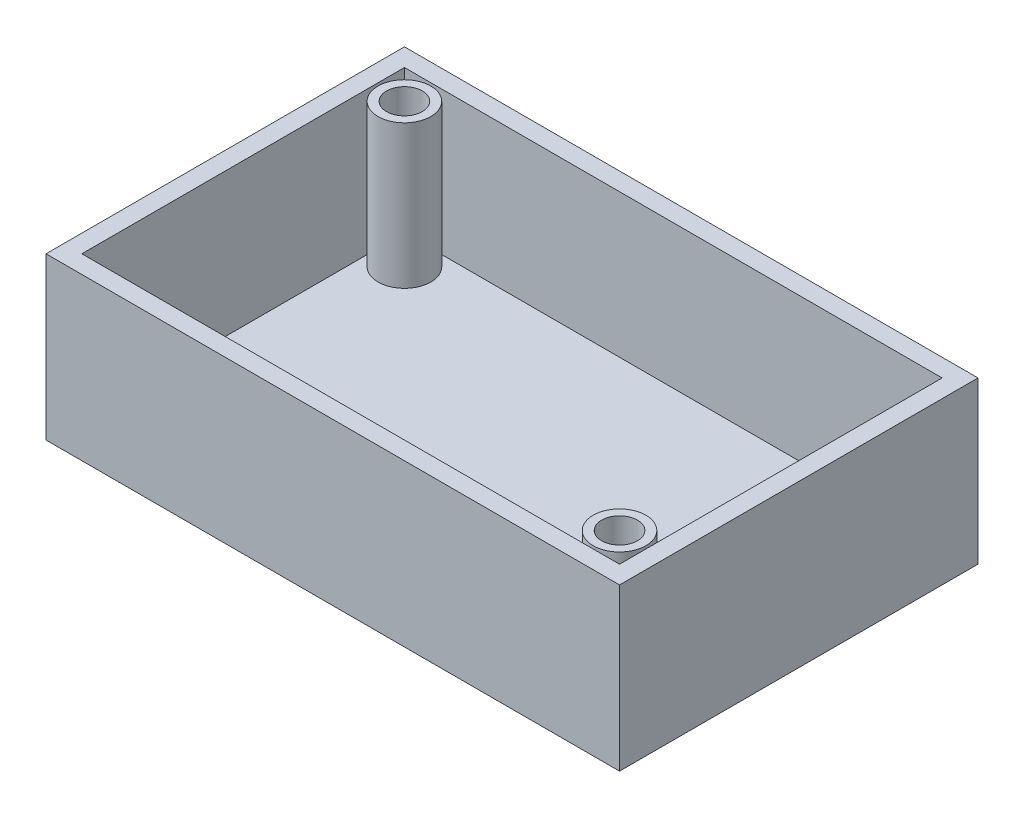
ISO-10303-21;
HEADER;
FILE_DESCRIPTION(('STEP AP214'),'2;1');
FILE_NAME('part.step','',(''),(''),'','','');
FILE_SCHEMA(('AUTOMOTIVE_DESIGN { 1 0 10303 214 1 1 1 1 }'));
ENDSEC;
DATA;
#1=APPLICATION_CONTEXT('core data for automotive mechanical design processes');
#2=APPLICATION_PROTOCOL_DEFINITION('international standard','automotive_design',2000,#1);
#3=PRODUCT_CONTEXT('',#1,'mechanical');
#4=PRODUCT('Part','Part','',(#3));
#5=PRODUCT_RELATED_PRODUCT_CATEGORY('part','',(#4));
#6=PRODUCT_DEFINITION_FORMATION('','',#4);
#7=PRODUCT_DEFINITION_CONTEXT('part definition',#1,'design');
#8=PRODUCT_DEFINITION('design','',#6,#7);
#9=PRODUCT_DEFINITION_SHAPE('','',#8);
#10=(LENGTH_UNIT() NAMED_UNIT(*) SI_UNIT(.MILLI.,.METRE.));
#11=(NAMED_UNIT(*) PLANE_ANGLE_UNIT() SI_UNIT($,.RADIAN.));
#12=(NAMED_UNIT(*) SI_UNIT($,.STERADIAN.) SOLID_ANGLE_UNIT());
#13=UNCERTAINTY_MEASURE_WITH_UNIT(LENGTH_MEASURE(1.E-05),#10,'distance_accuracy_value','');
#14=(GEOMETRIC_REPRESENTATION_CONTEXT(3) GLOBAL_UNCERTAINTY_ASSIGNED_CONTEXT((#13)) GLOBAL_UNIT_ASSIGNED_CONTEXT((#10,
#11,#12)) REPRESENTATION_CONTEXT('',''));
#15=CARTESIAN_POINT('',(0.,0.,0.));
#16=DIRECTION('',(0.,0.,1.));
#17=DIRECTION('',(1.,0.,0.));
#18=AXIS2_PLACEMENT_3D('',#15,#16,#17);
#19=CARTESIAN_POINT('',(-39.0769230769231,3.175,-55.545054945055));
#20=DIRECTION('',(1.,0.,0.));
#21=DIRECTION('',(0.,0.,-1.));
#22=AXIS2_PLACEMENT_3D('',#19,#20,#21);
#23=PLANE('',#22);
#24=DIRECTION('',(0.,0.,1.));
#25=VECTOR('',#24,1.);
#26=CARTESIAN_POINT('',(-39.0769230769231,0.,-55.545054945055));
#27=LINE('',#26,#25);
#28=CARTESIAN_POINT('',(-39.0769230769231,0.,-55.545054945055));
#29=VERTEX_POINT('',#28);
#30=CARTESIAN_POINT('',(-39.0769230769231,0.,7.95494505494504));
#31=VERTEX_POINT('',#30);
#32=EDGE_CURVE('E147',#29,#31,#27,.T.);
#33=ORIENTED_EDGE('',*,*,#32,.T.);
#34=DIRECTION('',(0.,-1.,0.));
#35=VECTOR('',#34,1.);
#36=CARTESIAN_POINT('',(-39.0769230769231,3.175,7.95494505494504));
#37=LINE('',#36,#35);
#38=CARTESIAN_POINT('',(-39.0769230769231,28.575,7.95494505494504));
#39=VERTEX_POINT('',#38);
#40=EDGE_CURVE('E165',#39,#31,#37,.T.);
#41=ORIENTED_EDGE('',*,*,#40,.F.);
#42=DIRECTION('',(0.,0.,1.));
#43=VECTOR('',#42,1.);
#44=CARTESIAN_POINT('',(-39.0769230769231,28.575,-55.545054945055));
#45=LINE('',#44,#43);
#46=CARTESIAN_POINT('',(-39.0769230769231,28.575,-55.545054945055));
#47=VERTEX_POINT('',#46);
#48=EDGE_CURVE('E138',#47,#39,#45,.T.);
#49=ORIENTED_EDGE('',*,*,#48,.F.);
#50=DIRECTION('',(0.,-1.,0.));
#51=VECTOR('',#50,1.);
#52=CARTESIAN_POINT('',(-39.0769230769231,3.175,-55.545054945055));
#53=LINE('',#52,#51);
#54=EDGE_CURVE('E156',#47,#29,#53,.T.);
#55=ORIENTED_EDGE('',*,*,#54,.T.);
#56=EDGE_LOOP('',(#33,#41,#49,#55));
#57=FACE_BOUND('',#56,.T.);
#58=ADVANCED_FACE('F34',(#57),#23,.F.);
#59=CARTESIAN_POINT('',(-39.0769230769231,3.175,7.95494505494504));
#60=DIRECTION('',(0.,0.,-1.));
#61=DIRECTION('',(-1.,0.,0.));
#62=AXIS2_PLACEMENT_3D('',#59,#60,#61);
#63=PLANE('',#62);
#64=DIRECTION('',(1.,0.,0.));
#65=VECTOR('',#64,1.);
#66=CARTESIAN_POINT('',(-39.0769230769231,0.,7.95494505494504));
#67=LINE('',#66,#65);
#68=CARTESIAN_POINT('',(62.5230769230769,0.,7.95494505494504));
#69=VERTEX_POINT('',#68);
#70=EDGE_CURVE('E150',#31,#69,#67,.T.);
#71=ORIENTED_EDGE('',*,*,#70,.T.);
#72=DIRECTION('',(0.,-1.,0.));
#73=VECTOR('',#72,1.);
#74=CARTESIAN_POINT('',(62.5230769230769,3.175,7.95494505494504));
#75=LINE('',#74,#73);
#76=CARTESIAN_POINT('',(62.5230769230769,28.575,7.95494505494504));
#77=VERTEX_POINT('',#76);
#78=EDGE_CURVE('E162',#77,#69,#75,.T.);
#79=ORIENTED_EDGE('',*,*,#78,.F.);
#80=DIRECTION('',(1.,0.,0.));
#81=VECTOR('',#80,1.);
#82=CARTESIAN_POINT('',(-39.0769230769231,28.575,7.95494505494504));
#83=LINE('',#82,#81);
#84=EDGE_CURVE('E141',#39,#77,#83,.T.);
#85=ORIENTED_EDGE('',*,*,#84,.F.);
#86=ORIENTED_EDGE('',*,*,#40,.T.);
#87=EDGE_LOOP('',(#71,#79,#85,#86));
#88=FACE_BOUND('',#87,.T.);
#89=ADVANCED_FACE('F199',(#88),#63,.F.);
#90=CARTESIAN_POINT('',(62.5230769230769,3.175,-55.545054945055));
#91=DIRECTION('',(-1.,0.,0.));
#92=DIRECTION('',(0.,0.,1.));
#93=AXIS2_PLACEMENT_3D('',#90,#91,#92);
#94=PLANE('',#93);
#95=DIRECTION('',(0.,0.,-1.));
#96=VECTOR('',#95,1.);
#97=CARTESIAN_POINT('',(62.5230769230769,0.,-55.545054945055));
#98=LINE('',#97,#96);
#99=CARTESIAN_POINT('',(62.5230769230769,0.,-55.545054945055));
#100=VERTEX_POINT('',#99);
#101=EDGE_CURVE('E152',#69,#100,#98,.T.);
#102=ORIENTED_EDGE('',*,*,#101,.T.);
#103=DIRECTION('',(0.,-1.,0.));
#104=VECTOR('',#103,1.);
#105=CARTESIAN_POINT('',(62.5230769230769,3.175,-55.545054945055));
#106=LINE('',#105,#104);
#107=CARTESIAN_POINT('',(62.5230769230769,28.575,-55.545054945055));
#108=VERTEX_POINT('',#107);
#109=EDGE_CURVE('E159',#108,#100,#106,.T.);
#110=ORIENTED_EDGE('',*,*,#109,.F.);
#111=DIRECTION('',(0.,0.,-1.));
#112=VECTOR('',#111,1.);
#113=CARTESIAN_POINT('',(62.5230769230769,28.575,7.95494505494504));
#114=LINE('',#113,#112);
#115=EDGE_CURVE('E144',#77,#108,#114,.T.);
#116=ORIENTED_EDGE('',*,*,#115,.F.);
#117=ORIENTED_EDGE('',*,*,#78,.T.);
#118=EDGE_LOOP('',(#102,#110,#116,#117));
#119=FACE_BOUND('',#118,.T.);
#120=ADVANCED_FACE('F204',(#119),#94,.F.);
#121=CARTESIAN_POINT('',(-39.0769230769231,3.175,-55.545054945055));
#122=DIRECTION('',(0.,0.,1.));
#123=DIRECTION('',(1.,0.,0.));
#124=AXIS2_PLACEMENT_3D('',#121,#122,#123);
#125=PLANE('',#124);
#126=DIRECTION('',(-1.,0.,0.));
#127=VECTOR('',#126,1.);
#128=CARTESIAN_POINT('',(-39.0769230769231,0.,-55.545054945055));
#129=LINE('',#128,#127);
#130=EDGE_CURVE('E154',#100,#29,#129,.T.);
#131=ORIENTED_EDGE('',*,*,#130,.T.);
#132=ORIENTED_EDGE('',*,*,#54,.F.);
#133=DIRECTION('',(-1.,0.,0.));
#134=VECTOR('',#133,1.);
#135=CARTESIAN_POINT('',(62.5230769230769,28.575,-55.545054945055));
#136=LINE('',#135,#134);
#137=EDGE_CURVE('E112',#108,#47,#136,.T.);
#138=ORIENTED_EDGE('',*,*,#137,.F.);
#139=ORIENTED_EDGE('',*,*,#109,.T.);
#140=EDGE_LOOP('',(#131,#132,#138,#139));
#141=FACE_BOUND('',#140,.T.);
#142=ADVANCED_FACE('F218',(#141),#125,.F.);
#143=CARTESIAN_POINT('',(0.,0.,0.));
#144=DIRECTION('',(0.,1.,0.));
#145=DIRECTION('',(0.,0.,1.));
#146=AXIS2_PLACEMENT_3D('',#143,#144,#145);
#147=PLANE('',#146);
#148=CARTESIAN_POINT('',(47.8144068358278,0.,-23.77728958125));
#149=DIRECTION('',(0.,-1.,0.));
#150=DIRECTION('',(0.,0.,-1.));
#151=AXIS2_PLACEMENT_3D('',#148,#149,#150);
#152=CIRCLE('',#151,2.14114132606958);
#153=CARTESIAN_POINT('',(47.8144068358278,0.,-25.9184309073196));
#154=VERTEX_POINT('',#153);
#155=EDGE_CURVE('E390',#154,#154,#152,.T.);
#156=ORIENTED_EDGE('',*,*,#155,.F.);
#157=EDGE_LOOP('',(#156));
#158=FACE_BOUND('',#157,.T.);
#159=ORIENTED_EDGE('',*,*,#32,.F.);
#160=ORIENTED_EDGE('',*,*,#130,.F.);
#161=ORIENTED_EDGE('',*,*,#101,.F.);
#162=ORIENTED_EDGE('',*,*,#70,.F.);
#163=EDGE_LOOP('',(#159,#160,#161,#162));
#164=FACE_BOUND('',#163,.T.);
#165=ADVANCED_FACE('F210',(#158,#164),#147,.F.);
#166=CARTESIAN_POINT('',(0.,28.575,0.));
#167=DIRECTION('',(0.,1.,0.));
#168=DIRECTION('',(0.,0.,1.));
#169=AXIS2_PLACEMENT_3D('',#166,#167,#168);
#170=PLANE('',#169);
#171=ORIENTED_EDGE('',*,*,#137,.T.);
#172=ORIENTED_EDGE('',*,*,#48,.T.);
#173=ORIENTED_EDGE('',*,*,#84,.T.);
#174=ORIENTED_EDGE('',*,*,#115,.T.);
#175=EDGE_LOOP('',(#171,#172,#173,#174));
#176=FACE_BOUND('',#175,.T.);
#177=DIRECTION('',(1.,0.,0.));
#178=VECTOR('',#177,1.);
#179=CARTESIAN_POINT('',(-35.9019230769231,28.575,4.77994505494504));
#180=LINE('',#179,#178);
#181=CARTESIAN_POINT('',(-35.9019230769231,28.575,4.77994505494504));
#182=VERTEX_POINT('',#181);
#183=CARTESIAN_POINT('',(59.3480769230769,28.575,4.77994505494504));
#184=VERTEX_POINT('',#183);
#185=EDGE_CURVE('E106',#182,#184,#180,.T.);
#186=ORIENTED_EDGE('',*,*,#185,.F.);
#187=DIRECTION('',(0.,0.,1.));
#188=VECTOR('',#187,1.);
#189=CARTESIAN_POINT('',(-35.9019230769231,28.575,-52.370054945055));
#190=LINE('',#189,#188);
#191=CARTESIAN_POINT('',(-35.9019230769231,28.575,-52.370054945055));
#192=VERTEX_POINT('',#191);
#193=EDGE_CURVE('E97',#192,#182,#190,.T.);
#194=ORIENTED_EDGE('',*,*,#193,.F.);
#195=DIRECTION('',(-1.,0.,0.));
#196=VECTOR('',#195,1.);
#197=CARTESIAN_POINT('',(59.3480769230769,28.575,-52.370054945055));
#198=LINE('',#197,#196);
#199=CARTESIAN_POINT('',(59.3480769230769,28.575,-52.370054945055));
#200=VERTEX_POINT('',#199);
#201=EDGE_CURVE('E120',#200,#192,#198,.T.);
#202=ORIENTED_EDGE('',*,*,#201,.F.);
#203=DIRECTION('',(0.,0.,-1.));
#204=VECTOR('',#203,1.);
#205=CARTESIAN_POINT('',(59.3480769230769,28.575,4.77994505494504));
#206=LINE('',#205,#204);
#207=EDGE_CURVE('E118',#184,#200,#206,.T.);
#208=ORIENTED_EDGE('',*,*,#207,.F.);
#209=EDGE_LOOP('',(#186,#194,#202,#208));
#210=FACE_BOUND('',#209,.T.);
#211=ADVANCED_FACE('F116',(#176,#210),#170,.T.);
#212=CARTESIAN_POINT('',(-35.9019230769231,28.575,-52.370054945055));
#213=DIRECTION('',(1.,0.,0.));
#214=DIRECTION('',(0.,0.,-1.));
#215=AXIS2_PLACEMENT_3D('',#212,#213,#214);
#216=PLANE('',#215);
#217=DIRECTION('',(0.,0.,1.));
#218=VECTOR('',#217,1.);
#219=CARTESIAN_POINT('',(-35.9019230769231,3.175,-52.370054945055));
#220=LINE('',#219,#218);
#221=CARTESIAN_POINT('',(-35.9019230769231,3.175,-52.370054945055));
#222=VERTEX_POINT('',#221);
#223=CARTESIAN_POINT('',(-35.9019230769231,3.175,4.77994505494504));
#224=VERTEX_POINT('',#223);
#225=EDGE_CURVE('E48',#222,#224,#220,.T.);
#226=ORIENTED_EDGE('',*,*,#225,.F.);
#227=DIRECTION('',(0.,-1.,0.));
#228=VECTOR('',#227,1.);
#229=CARTESIAN_POINT('',(-35.9019230769231,28.575,-52.370054945055));
#230=LINE('',#229,#228);
#231=EDGE_CURVE('E102',#192,#222,#230,.T.);
#232=ORIENTED_EDGE('',*,*,#231,.F.);
#233=ORIENTED_EDGE('',*,*,#193,.T.);
#234=DIRECTION('',(0.,-1.,0.));
#235=VECTOR('',#234,1.);
#236=CARTESIAN_POINT('',(-35.9019230769231,28.575,4.77994505494504));
#237=LINE('',#236,#235);
#238=EDGE_CURVE('E100',#182,#224,#237,.T.);
#239=ORIENTED_EDGE('',*,*,#238,.T.);
#240=EDGE_LOOP('',(#226,#232,#233,#239));
#241=FACE_BOUND('',#240,.T.);
#242=ADVANCED_FACE('F99',(#241),#216,.T.);
#243=CARTESIAN_POINT('',(-35.9019230769231,28.575,4.77994505494504));
#244=DIRECTION('',(0.,0.,-1.));
#245=DIRECTION('',(-1.,0.,0.));
#246=AXIS2_PLACEMENT_3D('',#243,#244,#245);
#247=PLANE('',#246);
#248=DIRECTION('',(1.,0.,0.));
#249=VECTOR('',#248,1.);
#250=CARTESIAN_POINT('',(-35.9019230769231,3.175,4.77994505494504));
#251=LINE('',#250,#249);
#252=CARTESIAN_POINT('',(59.3480769230769,3.175,4.77994505494504));
#253=VERTEX_POINT('',#252);
#254=EDGE_CURVE('E52',#224,#253,#251,.T.);
#255=ORIENTED_EDGE('',*,*,#254,.F.);
#256=ORIENTED_EDGE('',*,*,#238,.F.);
#257=ORIENTED_EDGE('',*,*,#185,.T.);
#258=DIRECTION('',(0.,-1.,0.));
#259=VECTOR('',#258,1.);
#260=CARTESIAN_POINT('',(59.3480769230769,28.575,4.77994505494504));
#261=LINE('',#260,#259);
#262=EDGE_CURVE('E113',#184,#253,#261,.T.);
#263=ORIENTED_EDGE('',*,*,#262,.T.);
#264=EDGE_LOOP('',(#255,#256,#257,#263));
#265=FACE_BOUND('',#264,.T.);
#266=ADVANCED_FACE('F110',(#265),#247,.T.);
#267=CARTESIAN_POINT('',(59.3480769230769,28.575,4.77994505494504));
#268=DIRECTION('',(-1.,0.,0.));
#269=DIRECTION('',(0.,0.,1.));
#270=AXIS2_PLACEMENT_3D('',#267,#268,#269);
#271=PLANE('',#270);
#272=DIRECTION('',(0.,0.,-1.));
#273=VECTOR('',#272,1.);
#274=CARTESIAN_POINT('',(59.3480769230769,3.175,4.77994505494504));
#275=LINE('',#274,#273);
#276=CARTESIAN_POINT('',(59.3480769230769,3.175,-52.370054945055));
#277=VERTEX_POINT('',#276);
#278=EDGE_CURVE('E128',#253,#277,#275,.T.);
#279=ORIENTED_EDGE('',*,*,#278,.F.);
#280=ORIENTED_EDGE('',*,*,#262,.F.);
#281=ORIENTED_EDGE('',*,*,#207,.T.);
#282=DIRECTION('',(0.,-1.,0.));
#283=VECTOR('',#282,1.);
#284=CARTESIAN_POINT('',(59.3480769230769,28.575,-52.370054945055));
#285=LINE('',#284,#283);
#286=EDGE_CURVE('E132',#200,#277,#285,.T.);
#287=ORIENTED_EDGE('',*,*,#286,.T.);
#288=EDGE_LOOP('',(#279,#280,#281,#287));
#289=FACE_BOUND('',#288,.T.);
#290=ADVANCED_FACE('F291',(#289),#271,.T.);
#291=CARTESIAN_POINT('',(59.3480769230769,28.575,-52.370054945055));
#292=DIRECTION('',(0.,0.,1.));
#293=DIRECTION('',(1.,0.,0.));
#294=AXIS2_PLACEMENT_3D('',#291,#292,#293);
#295=PLANE('',#294);
#296=DIRECTION('',(-1.,0.,0.));
#297=VECTOR('',#296,1.);
#298=CARTESIAN_POINT('',(59.3480769230769,3.175,-52.370054945055));
#299=LINE('',#298,#297);
#300=EDGE_CURVE('E107',#277,#222,#299,.T.);
#301=ORIENTED_EDGE('',*,*,#300,.F.);
#302=ORIENTED_EDGE('',*,*,#286,.F.);
#303=ORIENTED_EDGE('',*,*,#201,.T.);
#304=ORIENTED_EDGE('',*,*,#231,.T.);
#305=EDGE_LOOP('',(#301,#302,#303,#304));
#306=FACE_BOUND('',#305,.T.);
#307=ADVANCED_FACE('F193',(#306),#295,.T.);
#308=CARTESIAN_POINT('',(0.,3.175,0.));
#309=DIRECTION('',(0.,1.,0.));
#310=DIRECTION('',(0.,0.,1.));
#311=AXIS2_PLACEMENT_3D('',#308,#309,#310);
#312=PLANE('',#311);
#313=CARTESIAN_POINT('',(54.1680769230769,3.175,-0.400054945054966));
#314=DIRECTION('',(0.,1.,0.));
#315=DIRECTION('',(0.,0.,1.));
#316=AXIS2_PLACEMENT_3D('',#313,#314,#315);
#317=CIRCLE('',#316,4.675);
#318=CARTESIAN_POINT('',(54.1680769230769,3.175,4.27494505494503));
#319=VERTEX_POINT('',#318);
#320=EDGE_CURVE('E381',#319,#319,#317,.T.);
#321=ORIENTED_EDGE('',*,*,#320,.F.);
#322=EDGE_LOOP('',(#321));
#323=FACE_BOUND('',#322,.T.);
#324=CARTESIAN_POINT('',(-30.7269230769231,3.175,-47.190054945055));
#325=DIRECTION('',(0.,1.,0.));
#326=DIRECTION('',(0.,0.,1.));
#327=AXIS2_PLACEMENT_3D('',#324,#325,#326);
#328=CIRCLE('',#327,4.675);
#329=CARTESIAN_POINT('',(-30.7269230769231,3.175,-42.515054945055));
#330=VERTEX_POINT('',#329);
#331=EDGE_CURVE('E376',#330,#330,#328,.T.);
#332=ORIENTED_EDGE('',*,*,#331,.F.);
#333=EDGE_LOOP('',(#332));
#334=FACE_BOUND('',#333,.T.);
#335=CARTESIAN_POINT('',(47.8144068358278,3.175,-23.77728958125));
#336=DIRECTION('',(0.,-1.,0.));
#337=DIRECTION('',(0.,0.,-1.));
#338=AXIS2_PLACEMENT_3D('',#335,#336,#337);
#339=CIRCLE('',#338,2.14114132606958);
#340=CARTESIAN_POINT('',(47.8144068358278,3.175,-25.9184309073196));
#341=VERTEX_POINT('',#340);
#342=EDGE_CURVE('E126',#341,#341,#339,.T.);
#343=ORIENTED_EDGE('',*,*,#342,.T.);
#344=EDGE_LOOP('',(#343));
#345=FACE_BOUND('',#344,.T.);
#346=ORIENTED_EDGE('',*,*,#225,.T.);
#347=ORIENTED_EDGE('',*,*,#254,.T.);
#348=ORIENTED_EDGE('',*,*,#278,.T.);
#349=ORIENTED_EDGE('',*,*,#300,.T.);
#350=EDGE_LOOP('',(#346,#347,#348,#349));
#351=FACE_BOUND('',#350,.T.);
#352=ADVANCED_FACE('F177',(#323,#334,#345,#351),#312,.T.);
#353=CARTESIAN_POINT('',(47.8144068358278,3.175,-23.77728958125));
#354=DIRECTION('',(0.,-1.,0.));
#355=DIRECTION('',(0.,0.,-1.));
#356=AXIS2_PLACEMENT_3D('',#353,#354,#355);
#357=CYLINDRICAL_SURFACE('',#356,2.14114132606958);
#358=ORIENTED_EDGE('',*,*,#342,.F.);
#359=EDGE_LOOP('',(#358));
#360=FACE_BOUND('',#359,.T.);
#361=ORIENTED_EDGE('',*,*,#155,.T.);
#362=EDGE_LOOP('',(#361));
#363=FACE_BOUND('',#362,.T.);
#364=ADVANCED_FACE('F192',(#360,#363),#357,.F.);
#365=CARTESIAN_POINT('',(-30.7269230769231,28.575,-47.190054945055));
#366=DIRECTION('',(0.,-1.,0.));
#367=DIRECTION('',(0.,0.,-1.));
#368=AXIS2_PLACEMENT_3D('',#365,#366,#367);
#369=CYLINDRICAL_SURFACE('',#368,3.175);
#370=CARTESIAN_POINT('',(-30.7269230769231,28.575,-47.190054945055));
#371=DIRECTION('',(0.,1.,0.));
#372=DIRECTION('',(0.,0.,1.));
#373=AXIS2_PLACEMENT_3D('',#370,#371,#372);
#374=CIRCLE('',#373,3.175);
#375=CARTESIAN_POINT('',(-30.7269230769231,28.575,-44.015054945055));
#376=VERTEX_POINT('',#375);
#377=EDGE_CURVE('E379',#376,#376,#374,.T.);
#378=ORIENTED_EDGE('',*,*,#377,.T.);
#379=EDGE_LOOP('',(#378));
#380=FACE_BOUND('',#379,.T.);
#381=CARTESIAN_POINT('',(-30.7269230769231,3.175,-47.190054945055));
#382=DIRECTION('',(0.,1.,0.));
#383=DIRECTION('',(0.,0.,1.));
#384=AXIS2_PLACEMENT_3D('',#381,#382,#383);
#385=CIRCLE('',#384,3.175);
#386=CARTESIAN_POINT('',(-30.7269230769231,3.175,-44.015054945055));
#387=VERTEX_POINT('',#386);
#388=EDGE_CURVE('E41',#387,#387,#385,.F.);
#389=ORIENTED_EDGE('',*,*,#388,.T.);
#390=EDGE_LOOP('',(#389));
#391=FACE_BOUND('',#390,.T.);
#392=ADVANCED_FACE('F170',(#380,#391),#369,.F.);
#393=CARTESIAN_POINT('',(-30.7269230769231,28.575,-47.190054945055));
#394=DIRECTION('',(0.,-1.,0.));
#395=DIRECTION('',(0.,0.,-1.));
#396=AXIS2_PLACEMENT_3D('',#393,#394,#395);
#397=CYLINDRICAL_SURFACE('',#396,4.675);
#398=CARTESIAN_POINT('',(-30.7269230769231,28.575,-47.190054945055));
#399=DIRECTION('',(0.,1.,0.));
#400=DIRECTION('',(0.,0.,1.));
#401=AXIS2_PLACEMENT_3D('',#398,#399,#400);
#402=CIRCLE('',#401,4.675);
#403=CARTESIAN_POINT('',(-30.7269230769231,28.575,-42.515054945055));
#404=VERTEX_POINT('',#403);
#405=EDGE_CURVE('E388',#404,#404,#402,.T.);
#406=ORIENTED_EDGE('',*,*,#405,.F.);
#407=EDGE_LOOP('',(#406));
#408=FACE_BOUND('',#407,.T.);
#409=ORIENTED_EDGE('',*,*,#331,.T.);
#410=EDGE_LOOP('',(#409));
#411=FACE_BOUND('',#410,.T.);
#412=ADVANCED_FACE('F186',(#408,#411),#397,.T.);
#413=CARTESIAN_POINT('',(0.,28.575,0.));
#414=DIRECTION('',(0.,1.,0.));
#415=DIRECTION('',(0.,0.,1.));
#416=AXIS2_PLACEMENT_3D('',#413,#414,#415);
#417=PLANE('',#416);
#418=ORIENTED_EDGE('',*,*,#377,.F.);
#419=EDGE_LOOP('',(#418));
#420=FACE_BOUND('',#419,.T.);
#421=ORIENTED_EDGE('',*,*,#405,.T.);
#422=EDGE_LOOP('',(#421));
#423=FACE_BOUND('',#422,.T.);
#424=ADVANCED_FACE('F175',(#420,#423),#417,.T.);
#425=ORIENTED_EDGE('',*,*,#388,.F.);
#426=EDGE_LOOP('',(#425));
#427=FACE_BOUND('',#426,.T.);
#428=ADVANCED_FACE('F172',(#427),#312,.T.);
#429=CARTESIAN_POINT('',(54.1680769230769,28.575,-0.400054945054966));
#430=DIRECTION('',(0.,-1.,0.));
#431=DIRECTION('',(0.,0.,-1.));
#432=AXIS2_PLACEMENT_3D('',#429,#430,#431);
#433=CYLINDRICAL_SURFACE('',#432,3.175);
#434=CARTESIAN_POINT('',(54.1680769230769,28.575,-0.400054945054966));
#435=DIRECTION('',(0.,1.,0.));
#436=DIRECTION('',(0.,0.,1.));
#437=AXIS2_PLACEMENT_3D('',#434,#435,#436);
#438=CIRCLE('',#437,3.175);
#439=CARTESIAN_POINT('',(54.1680769230769,28.575,2.77494505494503));
#440=VERTEX_POINT('',#439);
#441=EDGE_CURVE('E372',#440,#440,#438,.T.);
#442=ORIENTED_EDGE('',*,*,#441,.T.);
#443=EDGE_LOOP('',(#442));
#444=FACE_BOUND('',#443,.T.);
#445=CARTESIAN_POINT('',(54.1680769230769,3.175,-0.400054945054966));
#446=DIRECTION('',(0.,1.,0.));
#447=DIRECTION('',(0.,0.,1.));
#448=AXIS2_PLACEMENT_3D('',#445,#446,#447);
#449=CIRCLE('',#448,3.175);
#450=CARTESIAN_POINT('',(54.1680769230769,3.175,2.77494505494503));
#451=VERTEX_POINT('',#450);
#452=EDGE_CURVE('E11',#451,#451,#449,.F.);
#453=ORIENTED_EDGE('',*,*,#452,.T.);
#454=EDGE_LOOP('',(#453));
#455=FACE_BOUND('',#454,.T.);
#456=ADVANCED_FACE('F174',(#444,#455),#433,.F.);
#457=CARTESIAN_POINT('',(54.1680769230769,28.575,-0.400054945054966));
#458=DIRECTION('',(0.,-1.,0.));
#459=DIRECTION('',(0.,0.,-1.));
#460=AXIS2_PLACEMENT_3D('',#457,#458,#459);
#461=CYLINDRICAL_SURFACE('',#460,4.675);
#462=CARTESIAN_POINT('',(54.1680769230769,28.575,-0.400054945054966));
#463=DIRECTION('',(0.,1.,0.));
#464=DIRECTION('',(0.,0.,1.));
#465=AXIS2_PLACEMENT_3D('',#462,#463,#464);
#466=CIRCLE('',#465,4.675);
#467=CARTESIAN_POINT('',(54.1680769230769,28.575,4.27494505494503));
#468=VERTEX_POINT('',#467);
#469=EDGE_CURVE('E375',#468,#468,#466,.T.);
#470=ORIENTED_EDGE('',*,*,#469,.F.);
#471=EDGE_LOOP('',(#470));
#472=FACE_BOUND('',#471,.T.);
#473=ORIENTED_EDGE('',*,*,#320,.T.);
#474=EDGE_LOOP('',(#473));
#475=FACE_BOUND('',#474,.T.);
#476=ADVANCED_FACE('F183',(#472,#475),#461,.T.);
#477=CARTESIAN_POINT('',(0.,28.575,0.));
#478=DIRECTION('',(0.,1.,0.));
#479=DIRECTION('',(0.,0.,1.));
#480=AXIS2_PLACEMENT_3D('',#477,#478,#479);
#481=PLANE('',#480);
#482=ORIENTED_EDGE('',*,*,#441,.F.);
#483=EDGE_LOOP('',(#482));
#484=FACE_BOUND('',#483,.T.);
#485=ORIENTED_EDGE('',*,*,#469,.T.);
#486=EDGE_LOOP('',(#485));
#487=FACE_BOUND('',#486,.T.);
#488=ADVANCED_FACE('F196',(#484,#487),#481,.T.);
#489=ORIENTED_EDGE('',*,*,#452,.F.);
#490=EDGE_LOOP('',(#489));
#491=FACE_BOUND('',#490,.T.);
#492=ADVANCED_FACE('F178',(#491),#312,.T.);
#493=CLOSED_SHELL('',(#58,#89,#120,#142,#165,#211,#242,#266,#290,#307,#352,#364,#392,#412,#424,
#428,#456,#476,#488,#492));
#494=MANIFOLD_SOLID_BREP('B2',#493);
#495=ADVANCED_BREP_SHAPE_REPRESENTATION('',(#18,#494),#14);
#496=SHAPE_DEFINITION_REPRESENTATION(#9,#495);
ENDSEC;
END-ISO-10303-21;
